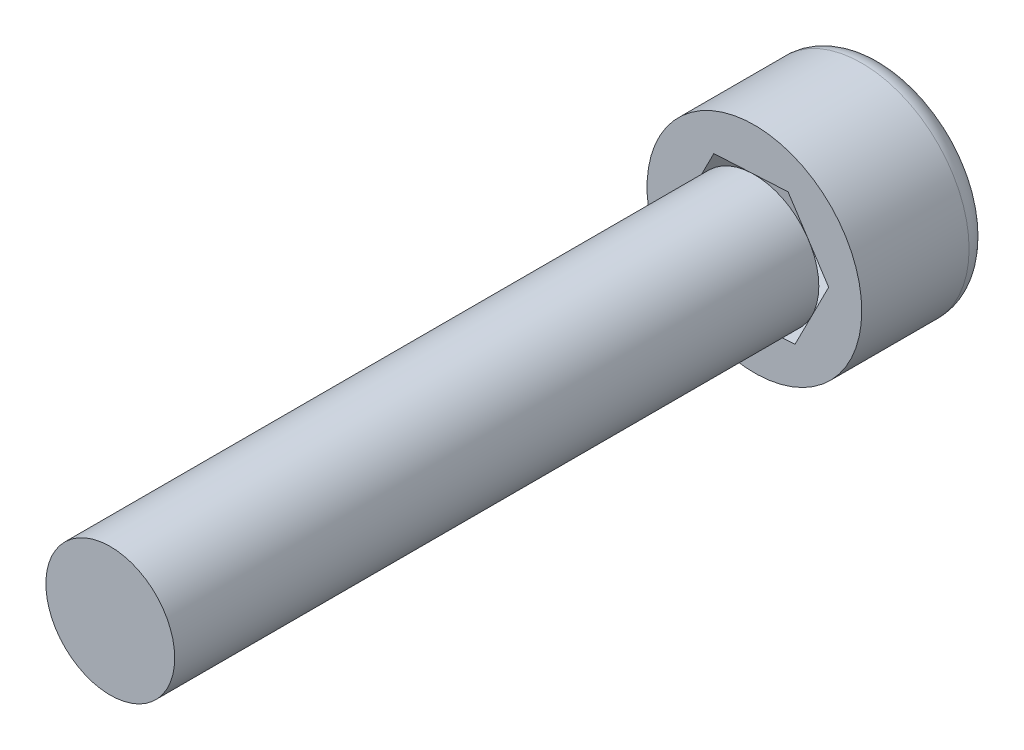
ISO-10303-21;
HEADER;
FILE_DESCRIPTION(('STEP AP214'),'2;1');
FILE_NAME('part.step','',(''),(''),'','','');
FILE_SCHEMA(('AUTOMOTIVE_DESIGN { 1 0 10303 214 1 1 1 1 }'));
ENDSEC;
DATA;
#1=APPLICATION_CONTEXT('core data for automotive mechanical design processes');
#2=APPLICATION_PROTOCOL_DEFINITION('international standard','automotive_design',2000,#1);
#3=PRODUCT_CONTEXT('',#1,'mechanical');
#4=PRODUCT('Part','Part','',(#3));
#5=PRODUCT_RELATED_PRODUCT_CATEGORY('part','',(#4));
#6=PRODUCT_DEFINITION_FORMATION('','',#4);
#7=PRODUCT_DEFINITION_CONTEXT('part definition',#1,'design');
#8=PRODUCT_DEFINITION('design','',#6,#7);
#9=PRODUCT_DEFINITION_SHAPE('','',#8);
#10=(LENGTH_UNIT() NAMED_UNIT(*) SI_UNIT(.MILLI.,.METRE.));
#11=(NAMED_UNIT(*) PLANE_ANGLE_UNIT() SI_UNIT($,.RADIAN.));
#12=(NAMED_UNIT(*) SI_UNIT($,.STERADIAN.) SOLID_ANGLE_UNIT());
#13=UNCERTAINTY_MEASURE_WITH_UNIT(LENGTH_MEASURE(1.E-05),#10,'distance_accuracy_value','');
#14=(GEOMETRIC_REPRESENTATION_CONTEXT(3) GLOBAL_UNCERTAINTY_ASSIGNED_CONTEXT((#13)) GLOBAL_UNIT_ASSIGNED_CONTEXT((#10,
#11,#12)) REPRESENTATION_CONTEXT('',''));
#15=CARTESIAN_POINT('',(0.,0.,0.));
#16=DIRECTION('',(0.,0.,1.));
#17=DIRECTION('',(1.,0.,0.));
#18=AXIS2_PLACEMENT_3D('',#15,#16,#17);
#19=CARTESIAN_POINT('',(0.,0.,3.));
#20=DIRECTION('',(0.,0.,-1.));
#21=DIRECTION('',(-1.,0.,0.));
#22=AXIS2_PLACEMENT_3D('',#19,#20,#21);
#23=CYLINDRICAL_SURFACE('',#22,2.5);
#24=CARTESIAN_POINT('',(0.,0.,0.5));
#25=DIRECTION('',(0.,0.,1.));
#26=DIRECTION('',(1.,0.,0.));
#27=AXIS2_PLACEMENT_3D('',#24,#25,#26);
#28=CIRCLE('',#27,2.5);
#29=CARTESIAN_POINT('',(2.5,0.,0.5));
#30=VERTEX_POINT('',#29);
#31=EDGE_CURVE('E49',#30,#30,#28,.T.);
#32=ORIENTED_EDGE('',*,*,#31,.T.);
#33=EDGE_LOOP('',(#32));
#34=FACE_BOUND('',#33,.T.);
#35=CARTESIAN_POINT('',(0.,0.,3.));
#36=DIRECTION('',(0.,0.,1.));
#37=DIRECTION('',(1.,0.,0.));
#38=AXIS2_PLACEMENT_3D('',#35,#36,#37);
#39=CIRCLE('',#38,2.5);
#40=CARTESIAN_POINT('',(2.5,0.,3.));
#41=VERTEX_POINT('',#40);
#42=EDGE_CURVE('E164',#41,#41,#39,.T.);
#43=ORIENTED_EDGE('',*,*,#42,.F.);
#44=EDGE_LOOP('',(#43));
#45=FACE_BOUND('',#44,.T.);
#46=ADVANCED_FACE('F40',(#34,#45),#23,.T.);
#47=CARTESIAN_POINT('',(0.,0.,3.));
#48=DIRECTION('',(0.,0.,1.));
#49=DIRECTION('',(1.,0.,0.));
#50=AXIS2_PLACEMENT_3D('',#47,#48,#49);
#51=PLANE('',#50);
#52=DIRECTION('',(-0.998565318577122,-0.0535472178079434,0.));
#53=VECTOR('',#52,1.);
#54=CARTESIAN_POINT('',(0.945103759937804,-1.45147472694203,3.));
#55=LINE('',#54,#53);
#56=CARTESIAN_POINT('',(0.945103759937804,-1.45147472694203,3.));
#57=VERTEX_POINT('',#56);
#58=CARTESIAN_POINT('',(-0.784462106513973,-1.54422122878934,3.));
#59=VERTEX_POINT('',#58);
#60=EDGE_CURVE('E93',#57,#59,#55,.T.);
#61=ORIENTED_EDGE('',*,*,#60,.T.);
#62=DIRECTION('',(-0.545655910212218,0.838009324321917,0.));
#63=VECTOR('',#62,1.);
#64=CARTESIAN_POINT('',(-0.784462106513973,-1.54422122878934,3.));
#65=LINE('',#64,#63);
#66=CARTESIAN_POINT('',(-1.72956586645178,-0.0927465018473138,3.));
#67=VERTEX_POINT('',#66);
#68=EDGE_CURVE('E56',#59,#67,#65,.T.);
#69=ORIENTED_EDGE('',*,*,#68,.T.);
#70=DIRECTION('',(0.452909408364904,0.89155654212986,0.));
#71=VECTOR('',#70,1.);
#72=CARTESIAN_POINT('',(-1.72956586645178,-0.0927465018473138,3.));
#73=LINE('',#72,#71);
#74=CARTESIAN_POINT('',(-0.945103759937803,1.45147472694203,3.));
#75=VERTEX_POINT('',#74);
#76=EDGE_CURVE('E103',#67,#75,#73,.T.);
#77=ORIENTED_EDGE('',*,*,#76,.T.);
#78=DIRECTION('',(0.998565318577122,0.0535472178079431,0.));
#79=VECTOR('',#78,1.);
#80=CARTESIAN_POINT('',(-0.945103759937803,1.45147472694203,3.));
#81=LINE('',#80,#79);
#82=CARTESIAN_POINT('',(0.784462106513974,1.54422122878934,3.));
#83=VERTEX_POINT('',#82);
#84=EDGE_CURVE('E175',#75,#83,#81,.T.);
#85=ORIENTED_EDGE('',*,*,#84,.T.);
#86=DIRECTION('',(0.545655910212218,-0.838009324321917,0.));
#87=VECTOR('',#86,1.);
#88=CARTESIAN_POINT('',(0.784462106513974,1.54422122878934,3.));
#89=LINE('',#88,#87);
#90=CARTESIAN_POINT('',(1.72956586645178,0.0927465018473145,3.));
#91=VERTEX_POINT('',#90);
#92=EDGE_CURVE('E173',#83,#91,#89,.T.);
#93=ORIENTED_EDGE('',*,*,#92,.T.);
#94=DIRECTION('',(-0.452909408364904,-0.89155654212986,0.));
#95=VECTOR('',#94,1.);
#96=CARTESIAN_POINT('',(1.72956586645178,0.0927465018473145,3.));
#97=LINE('',#96,#95);
#98=EDGE_CURVE('E108',#91,#57,#97,.T.);
#99=ORIENTED_EDGE('',*,*,#98,.T.);
#100=EDGE_LOOP('',(#61,#69,#77,#85,#93,#99));
#101=FACE_BOUND('',#100,.T.);
#102=ORIENTED_EDGE('',*,*,#42,.T.);
#103=EDGE_LOOP('',(#102));
#104=FACE_BOUND('',#103,.T.);
#105=ADVANCED_FACE('F105',(#101,#104),#51,.T.);
#106=CARTESIAN_POINT('',(0.,0.,0.));
#107=DIRECTION('',(0.,0.,1.));
#108=DIRECTION('',(1.,0.,0.));
#109=AXIS2_PLACEMENT_3D('',#106,#107,#108);
#110=PLANE('',#109);
#111=CARTESIAN_POINT('',(0.,0.,0.));
#112=DIRECTION('',(0.,0.,1.));
#113=DIRECTION('',(1.,0.,0.));
#114=AXIS2_PLACEMENT_3D('',#111,#112,#113);
#115=CIRCLE('',#114,2.);
#116=CARTESIAN_POINT('',(2.,0.,0.));
#117=VERTEX_POINT('',#116);
#118=EDGE_CURVE('E12',#117,#117,#115,.F.);
#119=ORIENTED_EDGE('',*,*,#118,.T.);
#120=EDGE_LOOP('',(#119));
#121=FACE_BOUND('',#120,.T.);
#122=DIRECTION('',(-0.545655910212218,0.838009324321917,0.));
#123=VECTOR('',#122,1.);
#124=CARTESIAN_POINT('',(-0.784462106513973,-1.54422122878934,0.));
#125=LINE('',#124,#123);
#126=CARTESIAN_POINT('',(-0.784462106513973,-1.54422122878934,0.));
#127=VERTEX_POINT('',#126);
#128=CARTESIAN_POINT('',(-1.72956586645178,-0.0927465018473138,0.));
#129=VERTEX_POINT('',#128);
#130=EDGE_CURVE('E98',#127,#129,#125,.T.);
#131=ORIENTED_EDGE('',*,*,#130,.F.);
#132=DIRECTION('',(-0.998565318577122,-0.0535472178079434,0.));
#133=VECTOR('',#132,1.);
#134=CARTESIAN_POINT('',(0.945103759937804,-1.45147472694203,0.));
#135=LINE('',#134,#133);
#136=CARTESIAN_POINT('',(0.945103759937804,-1.45147472694203,0.));
#137=VERTEX_POINT('',#136);
#138=EDGE_CURVE('E89',#137,#127,#135,.T.);
#139=ORIENTED_EDGE('',*,*,#138,.F.);
#140=DIRECTION('',(-0.452909408364904,-0.89155654212986,0.));
#141=VECTOR('',#140,1.);
#142=CARTESIAN_POINT('',(1.72956586645178,0.0927465018473145,0.));
#143=LINE('',#142,#141);
#144=CARTESIAN_POINT('',(1.72956586645178,0.0927465018473145,0.));
#145=VERTEX_POINT('',#144);
#146=EDGE_CURVE('E155',#145,#137,#143,.T.);
#147=ORIENTED_EDGE('',*,*,#146,.F.);
#148=DIRECTION('',(0.545655910212218,-0.838009324321917,0.));
#149=VECTOR('',#148,1.);
#150=CARTESIAN_POINT('',(0.784462106513974,1.54422122878934,0.));
#151=LINE('',#150,#149);
#152=CARTESIAN_POINT('',(0.784462106513974,1.54422122878934,0.));
#153=VERTEX_POINT('',#152);
#154=EDGE_CURVE('E188',#153,#145,#151,.T.);
#155=ORIENTED_EDGE('',*,*,#154,.F.);
#156=DIRECTION('',(0.998565318577122,0.0535472178079431,0.));
#157=VECTOR('',#156,1.);
#158=CARTESIAN_POINT('',(-0.945103759937803,1.45147472694203,0.));
#159=LINE('',#158,#157);
#160=CARTESIAN_POINT('',(-0.945103759937803,1.45147472694203,0.));
#161=VERTEX_POINT('',#160);
#162=EDGE_CURVE('E184',#161,#153,#159,.T.);
#163=ORIENTED_EDGE('',*,*,#162,.F.);
#164=DIRECTION('',(0.452909408364904,0.89155654212986,0.));
#165=VECTOR('',#164,1.);
#166=CARTESIAN_POINT('',(-1.72956586645178,-0.0927465018473138,0.));
#167=LINE('',#166,#165);
#168=EDGE_CURVE('E181',#129,#161,#167,.T.);
#169=ORIENTED_EDGE('',*,*,#168,.F.);
#170=EDGE_LOOP('',(#131,#139,#147,#155,#163,#169));
#171=FACE_BOUND('',#170,.T.);
#172=ADVANCED_FACE('F130',(#121,#171),#110,.F.);
#173=CARTESIAN_POINT('',(0.945103759937804,-1.45147472694203,3.));
#174=DIRECTION('',(0.0535472178079434,-0.998565318577122,0.));
#175=DIRECTION('',(0.998565318577122,0.0535472178079434,0.));
#176=AXIS2_PLACEMENT_3D('',#173,#174,#175);
#177=PLANE('',#176);
#178=ORIENTED_EDGE('',*,*,#138,.T.);
#179=DIRECTION('',(0.,0.,-1.));
#180=VECTOR('',#179,1.);
#181=CARTESIAN_POINT('',(-0.784462106513973,-1.54422122878934,3.));
#182=LINE('',#181,#180);
#183=EDGE_CURVE('E91',#59,#127,#182,.T.);
#184=ORIENTED_EDGE('',*,*,#183,.F.);
#185=ORIENTED_EDGE('',*,*,#60,.F.);
#186=DIRECTION('',(0.,0.,-1.));
#187=VECTOR('',#186,1.);
#188=CARTESIAN_POINT('',(0.945103759937804,-1.45147472694203,3.));
#189=LINE('',#188,#187);
#190=EDGE_CURVE('E156',#57,#137,#189,.T.);
#191=ORIENTED_EDGE('',*,*,#190,.T.);
#192=EDGE_LOOP('',(#178,#184,#185,#191));
#193=FACE_BOUND('',#192,.T.);
#194=ADVANCED_FACE('F92',(#193),#177,.F.);
#195=CARTESIAN_POINT('',(1.72956586645178,0.0927465018473145,3.));
#196=DIRECTION('',(0.89155654212986,-0.452909408364904,0.));
#197=DIRECTION('',(0.452909408364904,0.89155654212986,0.));
#198=AXIS2_PLACEMENT_3D('',#195,#196,#197);
#199=PLANE('',#198);
#200=ORIENTED_EDGE('',*,*,#146,.T.);
#201=ORIENTED_EDGE('',*,*,#190,.F.);
#202=ORIENTED_EDGE('',*,*,#98,.F.);
#203=DIRECTION('',(0.,0.,-1.));
#204=VECTOR('',#203,1.);
#205=CARTESIAN_POINT('',(1.72956586645178,0.0927465018473145,3.));
#206=LINE('',#205,#204);
#207=EDGE_CURVE('E158',#91,#145,#206,.T.);
#208=ORIENTED_EDGE('',*,*,#207,.T.);
#209=EDGE_LOOP('',(#200,#201,#202,#208));
#210=FACE_BOUND('',#209,.T.);
#211=ADVANCED_FACE('F137',(#210),#199,.F.);
#212=CARTESIAN_POINT('',(0.784462106513974,1.54422122878934,3.));
#213=DIRECTION('',(0.838009324321917,0.545655910212218,0.));
#214=DIRECTION('',(-0.545655910212218,0.838009324321917,0.));
#215=AXIS2_PLACEMENT_3D('',#212,#213,#214);
#216=PLANE('',#215);
#217=ORIENTED_EDGE('',*,*,#154,.T.);
#218=ORIENTED_EDGE('',*,*,#207,.F.);
#219=ORIENTED_EDGE('',*,*,#92,.F.);
#220=DIRECTION('',(0.,0.,-1.));
#221=VECTOR('',#220,1.);
#222=CARTESIAN_POINT('',(0.784462106513974,1.54422122878934,3.));
#223=LINE('',#222,#221);
#224=EDGE_CURVE('E186',#83,#153,#223,.T.);
#225=ORIENTED_EDGE('',*,*,#224,.T.);
#226=EDGE_LOOP('',(#217,#218,#219,#225));
#227=FACE_BOUND('',#226,.T.);
#228=ADVANCED_FACE('F145',(#227),#216,.F.);
#229=CARTESIAN_POINT('',(-0.945103759937803,1.45147472694203,3.));
#230=DIRECTION('',(-0.0535472178079431,0.998565318577122,0.));
#231=DIRECTION('',(-0.998565318577122,-0.0535472178079432,0.));
#232=AXIS2_PLACEMENT_3D('',#229,#230,#231);
#233=PLANE('',#232);
#234=ORIENTED_EDGE('',*,*,#162,.T.);
#235=ORIENTED_EDGE('',*,*,#224,.F.);
#236=ORIENTED_EDGE('',*,*,#84,.F.);
#237=DIRECTION('',(0.,0.,-1.));
#238=VECTOR('',#237,1.);
#239=CARTESIAN_POINT('',(-0.945103759937803,1.45147472694203,3.));
#240=LINE('',#239,#238);
#241=EDGE_CURVE('E180',#75,#161,#240,.T.);
#242=ORIENTED_EDGE('',*,*,#241,.T.);
#243=EDGE_LOOP('',(#234,#235,#236,#242));
#244=FACE_BOUND('',#243,.T.);
#245=ADVANCED_FACE('F141',(#244),#233,.F.);
#246=CARTESIAN_POINT('',(-1.72956586645178,-0.0927465018473138,3.));
#247=DIRECTION('',(-0.89155654212986,0.452909408364904,0.));
#248=DIRECTION('',(-0.452909408364904,-0.89155654212986,0.));
#249=AXIS2_PLACEMENT_3D('',#246,#247,#248);
#250=PLANE('',#249);
#251=ORIENTED_EDGE('',*,*,#168,.T.);
#252=ORIENTED_EDGE('',*,*,#241,.F.);
#253=ORIENTED_EDGE('',*,*,#76,.F.);
#254=DIRECTION('',(0.,0.,-1.));
#255=VECTOR('',#254,1.);
#256=CARTESIAN_POINT('',(-1.72956586645178,-0.0927465018473138,3.));
#257=LINE('',#256,#255);
#258=EDGE_CURVE('E101',#67,#129,#257,.T.);
#259=ORIENTED_EDGE('',*,*,#258,.T.);
#260=EDGE_LOOP('',(#251,#252,#253,#259));
#261=FACE_BOUND('',#260,.T.);
#262=ADVANCED_FACE('F122',(#261),#250,.F.);
#263=CARTESIAN_POINT('',(-0.784462106513973,-1.54422122878934,3.));
#264=DIRECTION('',(-0.838009324321917,-0.545655910212218,0.));
#265=DIRECTION('',(0.545655910212218,-0.838009324321917,0.));
#266=AXIS2_PLACEMENT_3D('',#263,#264,#265);
#267=PLANE('',#266);
#268=ORIENTED_EDGE('',*,*,#130,.T.);
#269=ORIENTED_EDGE('',*,*,#258,.F.);
#270=ORIENTED_EDGE('',*,*,#68,.F.);
#271=ORIENTED_EDGE('',*,*,#183,.T.);
#272=EDGE_LOOP('',(#268,#269,#270,#271));
#273=FACE_BOUND('',#272,.T.);
#274=ADVANCED_FACE('F100',(#273),#267,.F.);
#275=CARTESIAN_POINT('',(0.,0.,0.5));
#276=DIRECTION('',(0.,0.,1.));
#277=DIRECTION('',(1.,0.,0.));
#278=AXIS2_PLACEMENT_3D('',#275,#276,#277);
#279=TOROIDAL_SURFACE('',#278,2.,0.5);
#280=ORIENTED_EDGE('',*,*,#118,.F.);
#281=EDGE_LOOP('',(#280));
#282=FACE_BOUND('',#281,.T.);
#283=ORIENTED_EDGE('',*,*,#31,.F.);
#284=EDGE_LOOP('',(#283));
#285=FACE_BOUND('',#284,.T.);
#286=ADVANCED_FACE('F42',(#282,#285),#279,.T.);
#287=CLOSED_SHELL('',(#46,#105,#172,#194,#211,#228,#245,#262,#274,#286));
#288=MANIFOLD_SOLID_BREP('B2',#287);
#289=CARTESIAN_POINT('',(0.,0.,18.));
#290=DIRECTION('',(0.,0.,1.));
#291=DIRECTION('',(1.,0.,0.));
#292=AXIS2_PLACEMENT_3D('',#289,#290,#291);
#293=PLANE('',#292);
#294=CARTESIAN_POINT('',(0.,0.,18.));
#295=DIRECTION('',(0.,0.,1.));
#296=DIRECTION('',(1.,0.,0.));
#297=AXIS2_PLACEMENT_3D('',#294,#295,#296);
#298=CIRCLE('',#297,1.5);
#299=CARTESIAN_POINT('',(1.5,0.,18.));
#300=VERTEX_POINT('',#299);
#301=EDGE_CURVE('E258',#300,#300,#298,.T.);
#302=ORIENTED_EDGE('',*,*,#301,.T.);
#303=EDGE_LOOP('',(#302));
#304=FACE_BOUND('',#303,.T.);
#305=ADVANCED_FACE('F251',(#304),#293,.T.);
#306=CARTESIAN_POINT('',(0.,0.,18.));
#307=DIRECTION('',(0.,0.,-1.));
#308=DIRECTION('',(-1.,0.,0.));
#309=AXIS2_PLACEMENT_3D('',#306,#307,#308);
#310=CYLINDRICAL_SURFACE('',#309,1.5);
#311=ORIENTED_EDGE('',*,*,#301,.F.);
#312=EDGE_LOOP('',(#311));
#313=FACE_BOUND('',#312,.T.);
#314=CARTESIAN_POINT('',(0.,0.,3.));
#315=DIRECTION('',(0.,0.,1.));
#316=DIRECTION('',(1.,0.,0.));
#317=AXIS2_PLACEMENT_3D('',#314,#315,#316);
#318=CIRCLE('',#317,1.5);
#319=CARTESIAN_POINT('',(1.5,0.,3.));
#320=VERTEX_POINT('',#319);
#321=EDGE_CURVE('E39',#320,#320,#318,.T.);
#322=ORIENTED_EDGE('',*,*,#321,.T.);
#323=EDGE_LOOP('',(#322));
#324=FACE_BOUND('',#323,.T.);
#325=ADVANCED_FACE('F253',(#313,#324),#310,.T.);
#326=CARTESIAN_POINT('',(0.,0.,3.));
#327=DIRECTION('',(0.,0.,-1.));
#328=DIRECTION('',(-1.,0.,0.));
#329=AXIS2_PLACEMENT_3D('',#326,#327,#328);
#330=PLANE('',#329);
#331=ORIENTED_EDGE('',*,*,#321,.F.);
#332=EDGE_LOOP('',(#331));
#333=FACE_BOUND('',#332,.T.);
#334=ADVANCED_FACE('F266',(#333),#330,.T.);
#335=CLOSED_SHELL('',(#305,#325,#334));
#336=MANIFOLD_SOLID_BREP('B6',#335);
#337=ADVANCED_BREP_SHAPE_REPRESENTATION('',(#18,#288,#336),#14);
#338=SHAPE_DEFINITION_REPRESENTATION(#9,#337);
ENDSEC;
END-ISO-10303-21;
